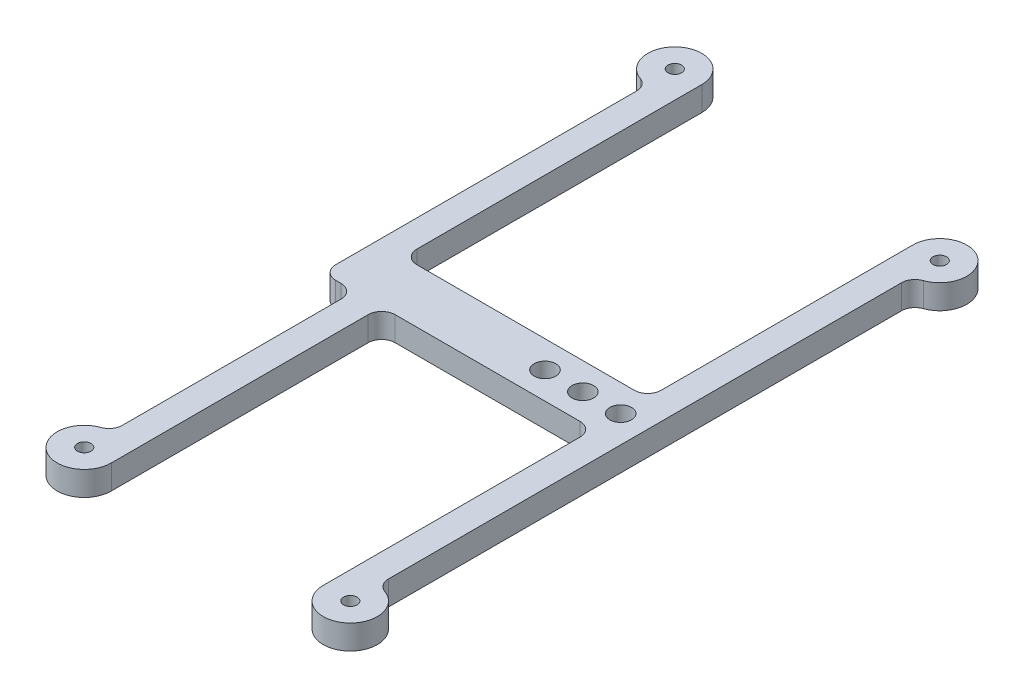
ISO-10303-21;
HEADER;
FILE_DESCRIPTION(('STEP AP214'),'2;1');
FILE_NAME('part.step','',(''),(''),'','','');
FILE_SCHEMA(('AUTOMOTIVE_DESIGN { 1 0 10303 214 1 1 1 1 }'));
ENDSEC;
DATA;
#1=APPLICATION_CONTEXT('core data for automotive mechanical design processes');
#2=APPLICATION_PROTOCOL_DEFINITION('international standard','automotive_design',2000,#1);
#3=PRODUCT_CONTEXT('',#1,'mechanical');
#4=PRODUCT('Part','Part','',(#3));
#5=PRODUCT_RELATED_PRODUCT_CATEGORY('part','',(#4));
#6=PRODUCT_DEFINITION_FORMATION('','',#4);
#7=PRODUCT_DEFINITION_CONTEXT('part definition',#1,'design');
#8=PRODUCT_DEFINITION('design','',#6,#7);
#9=PRODUCT_DEFINITION_SHAPE('','',#8);
#10=(LENGTH_UNIT() NAMED_UNIT(*) SI_UNIT(.MILLI.,.METRE.));
#11=(NAMED_UNIT(*) PLANE_ANGLE_UNIT() SI_UNIT($,.RADIAN.));
#12=(NAMED_UNIT(*) SI_UNIT($,.STERADIAN.) SOLID_ANGLE_UNIT());
#13=UNCERTAINTY_MEASURE_WITH_UNIT(LENGTH_MEASURE(1.E-05),#10,'distance_accuracy_value','');
#14=(GEOMETRIC_REPRESENTATION_CONTEXT(3) GLOBAL_UNCERTAINTY_ASSIGNED_CONTEXT((#13)) GLOBAL_UNIT_ASSIGNED_CONTEXT((#10,
#11,#12)) REPRESENTATION_CONTEXT('',''));
#15=CARTESIAN_POINT('',(0.,0.,0.));
#16=DIRECTION('',(0.,0.,1.));
#17=DIRECTION('',(1.,0.,0.));
#18=AXIS2_PLACEMENT_3D('',#15,#16,#17);
#19=CARTESIAN_POINT('',(-1.,4.5,0.));
#20=DIRECTION('',(1.,0.,0.));
#21=DIRECTION('',(0.,0.,-1.));
#22=AXIS2_PLACEMENT_3D('',#19,#20,#21);
#23=PLANE('',#22);
#24=DIRECTION('',(0.,0.,1.));
#25=VECTOR('',#24,1.);
#26=CARTESIAN_POINT('',(-1.,4.5,0.));
#27=LINE('',#26,#25);
#28=CARTESIAN_POINT('',(-1.00000000000001,4.5,-115.2));
#29=VERTEX_POINT('',#28);
#30=CARTESIAN_POINT('',(-1.00000000000001,4.5,-62.5));
#31=VERTEX_POINT('',#30);
#32=EDGE_CURVE('E201',#29,#31,#27,.T.);
#33=ORIENTED_EDGE('',*,*,#32,.T.);
#34=DIRECTION('',(0.,-1.,0.));
#35=VECTOR('',#34,1.);
#36=CARTESIAN_POINT('',(-1.00000000000001,4.5,-62.5));
#37=LINE('',#36,#35);
#38=CARTESIAN_POINT('',(-1.00000000000001,0.,-62.5));
#39=VERTEX_POINT('',#38);
#40=EDGE_CURVE('E356',#31,#39,#37,.T.);
#41=ORIENTED_EDGE('',*,*,#40,.T.);
#42=DIRECTION('',(0.,0.,1.));
#43=VECTOR('',#42,1.);
#44=CARTESIAN_POINT('',(-1.,0.,0.));
#45=LINE('',#44,#43);
#46=CARTESIAN_POINT('',(-1.00000000000001,0.,-115.2));
#47=VERTEX_POINT('',#46);
#48=EDGE_CURVE('E204',#47,#39,#45,.T.);
#49=ORIENTED_EDGE('',*,*,#48,.F.);
#50=DIRECTION('',(0.,-1.,0.));
#51=VECTOR('',#50,1.);
#52=CARTESIAN_POINT('',(-1.00000000000001,4.5,-115.2));
#53=LINE('',#52,#51);
#54=EDGE_CURVE('E197',#29,#47,#53,.T.);
#55=ORIENTED_EDGE('',*,*,#54,.F.);
#56=EDGE_LOOP('',(#33,#41,#49,#55));
#57=FACE_BOUND('',#56,.T.);
#58=ADVANCED_FACE('F35',(#57),#23,.T.);
#59=CARTESIAN_POINT('',(-6.00000000000002,4.5,-115.2));
#60=DIRECTION('',(0.,-1.,0.));
#61=DIRECTION('',(0.,0.,-1.));
#62=AXIS2_PLACEMENT_3D('',#59,#60,#61);
#63=CYLINDRICAL_SURFACE('',#62,5.);
#64=CARTESIAN_POINT('',(-6.00000000000002,0.,-115.2));
#65=DIRECTION('',(0.,1.,0.));
#66=DIRECTION('',(0.,0.,1.));
#67=AXIS2_PLACEMENT_3D('',#64,#65,#66);
#68=CIRCLE('',#67,5.);
#69=CARTESIAN_POINT('',(-7.66666666666668,0.,-110.48595479209));
#70=VERTEX_POINT('',#69);
#71=EDGE_CURVE('E283',#47,#70,#68,.T.);
#72=ORIENTED_EDGE('',*,*,#71,.T.);
#73=DIRECTION('',(0.,-1.,0.));
#74=VECTOR('',#73,1.);
#75=CARTESIAN_POINT('',(-7.66666666666668,4.5,-110.48595479209));
#76=LINE('',#75,#74);
#77=CARTESIAN_POINT('',(-7.66666666666668,4.5,-110.48595479209));
#78=VERTEX_POINT('',#77);
#79=EDGE_CURVE('E215',#70,#78,#76,.F.);
#80=ORIENTED_EDGE('',*,*,#79,.T.);
#81=CARTESIAN_POINT('',(-6.00000000000002,4.5,-115.2));
#82=DIRECTION('',(0.,1.,0.));
#83=DIRECTION('',(0.,0.,1.));
#84=AXIS2_PLACEMENT_3D('',#81,#82,#83);
#85=CIRCLE('',#84,5.);
#86=EDGE_CURVE('E212',#29,#78,#85,.T.);
#87=ORIENTED_EDGE('',*,*,#86,.F.);
#88=ORIENTED_EDGE('',*,*,#54,.T.);
#89=EDGE_LOOP('',(#72,#80,#87,#88));
#90=FACE_BOUND('',#89,.T.);
#91=ADVANCED_FACE('F213',(#90),#63,.T.);
#92=CARTESIAN_POINT('',(-6.,4.5,0.));
#93=DIRECTION('',(1.,0.,0.));
#94=DIRECTION('',(0.,0.,-1.));
#95=AXIS2_PLACEMENT_3D('',#92,#93,#94);
#96=PLANE('',#95);
#97=DIRECTION('',(0.,0.,1.));
#98=VECTOR('',#97,1.);
#99=CARTESIAN_POINT('',(-6.,4.5,0.));
#100=LINE('',#99,#98);
#101=CARTESIAN_POINT('',(-6.00000000000001,4.5,-108.128932188135));
#102=VERTEX_POINT('',#101);
#103=CARTESIAN_POINT('',(-6.00000000000001,4.5,-52.5));
#104=VERTEX_POINT('',#103);
#105=EDGE_CURVE('E217',#102,#104,#100,.T.);
#106=ORIENTED_EDGE('',*,*,#105,.F.);
#107=DIRECTION('',(0.,1.,0.));
#108=VECTOR('',#107,1.);
#109=CARTESIAN_POINT('',(-6.00000000000001,0.,-108.128932188135));
#110=LINE('',#109,#108);
#111=CARTESIAN_POINT('',(-6.00000000000001,0.,-108.128932188135));
#112=VERTEX_POINT('',#111);
#113=EDGE_CURVE('E380',#102,#112,#110,.F.);
#114=ORIENTED_EDGE('',*,*,#113,.T.);
#115=DIRECTION('',(0.,0.,1.));
#116=VECTOR('',#115,1.);
#117=CARTESIAN_POINT('',(-6.,0.,0.));
#118=LINE('',#117,#116);
#119=CARTESIAN_POINT('',(-6.00000000000001,0.,-52.5));
#120=VERTEX_POINT('',#119);
#121=EDGE_CURVE('E285',#112,#120,#118,.T.);
#122=ORIENTED_EDGE('',*,*,#121,.T.);
#123=DIRECTION('',(0.,-1.,0.));
#124=VECTOR('',#123,1.);
#125=CARTESIAN_POINT('',(-6.00000000000001,4.5,-52.5));
#126=LINE('',#125,#124);
#127=EDGE_CURVE('E378',#120,#104,#126,.F.);
#128=ORIENTED_EDGE('',*,*,#127,.T.);
#129=EDGE_LOOP('',(#106,#114,#122,#128));
#130=FACE_BOUND('',#129,.T.);
#131=ADVANCED_FACE('F516',(#130),#96,.F.);
#132=CARTESIAN_POINT('',(0.,4.5,-50.));
#133=DIRECTION('',(0.,0.,1.));
#134=DIRECTION('',(1.,0.,0.));
#135=AXIS2_PLACEMENT_3D('',#132,#133,#134);
#136=PLANE('',#135);
#137=DIRECTION('',(-1.,0.,0.));
#138=VECTOR('',#137,1.);
#139=CARTESIAN_POINT('',(0.,0.,-50.));
#140=LINE('',#139,#138);
#141=CARTESIAN_POINT('',(-2.5,0.,-50.));
#142=VERTEX_POINT('',#141);
#143=CARTESIAN_POINT('',(-3.50000000000001,0.,-50.));
#144=VERTEX_POINT('',#143);
#145=EDGE_CURVE('E288',#142,#144,#140,.T.);
#146=ORIENTED_EDGE('',*,*,#145,.F.);
#147=DIRECTION('',(0.,-1.,0.));
#148=VECTOR('',#147,1.);
#149=CARTESIAN_POINT('',(-2.5,4.5,-50.));
#150=LINE('',#149,#148);
#151=CARTESIAN_POINT('',(-2.5,4.5,-50.));
#152=VERTEX_POINT('',#151);
#153=EDGE_CURVE('E57',#142,#152,#150,.F.);
#154=ORIENTED_EDGE('',*,*,#153,.T.);
#155=DIRECTION('',(-1.,0.,0.));
#156=VECTOR('',#155,1.);
#157=CARTESIAN_POINT('',(0.,4.5,-50.));
#158=LINE('',#157,#156);
#159=CARTESIAN_POINT('',(-3.50000000000001,4.5,-50.));
#160=VERTEX_POINT('',#159);
#161=EDGE_CURVE('E231',#152,#160,#158,.T.);
#162=ORIENTED_EDGE('',*,*,#161,.T.);
#163=DIRECTION('',(0.,-1.,0.));
#164=VECTOR('',#163,1.);
#165=CARTESIAN_POINT('',(-3.50000000000001,0.,-50.));
#166=LINE('',#165,#164);
#167=EDGE_CURVE('E384',#160,#144,#166,.T.);
#168=ORIENTED_EDGE('',*,*,#167,.T.);
#169=EDGE_LOOP('',(#146,#154,#162,#168));
#170=FACE_BOUND('',#169,.T.);
#171=ADVANCED_FACE('F427',(#170),#136,.T.);
#172=CARTESIAN_POINT('',(0.,4.5,0.));
#173=DIRECTION('',(-1.,0.,0.));
#174=DIRECTION('',(0.,0.,1.));
#175=AXIS2_PLACEMENT_3D('',#172,#173,#174);
#176=PLANE('',#175);
#177=DIRECTION('',(0.,0.,-1.));
#178=VECTOR('',#177,1.);
#179=CARTESIAN_POINT('',(0.,0.,0.));
#180=LINE('',#179,#178);
#181=CARTESIAN_POINT('',(0.,0.,-7.07106781186548));
#182=VERTEX_POINT('',#181);
#183=CARTESIAN_POINT('',(0.,0.,-47.5));
#184=VERTEX_POINT('',#183);
#185=EDGE_CURVE('E291',#182,#184,#180,.T.);
#186=ORIENTED_EDGE('',*,*,#185,.F.);
#187=DIRECTION('',(0.,-1.,0.));
#188=VECTOR('',#187,1.);
#189=CARTESIAN_POINT('',(0.,4.5,-7.07106781186548));
#190=LINE('',#189,#188);
#191=CARTESIAN_POINT('',(0.,4.5,-7.07106781186548));
#192=VERTEX_POINT('',#191);
#193=EDGE_CURVE('E371',#182,#192,#190,.F.);
#194=ORIENTED_EDGE('',*,*,#193,.T.);
#195=DIRECTION('',(0.,0.,-1.));
#196=VECTOR('',#195,1.);
#197=CARTESIAN_POINT('',(0.,4.5,0.));
#198=LINE('',#197,#196);
#199=CARTESIAN_POINT('',(0.,4.5,-47.5));
#200=VERTEX_POINT('',#199);
#201=EDGE_CURVE('E233',#192,#200,#198,.T.);
#202=ORIENTED_EDGE('',*,*,#201,.T.);
#203=DIRECTION('',(0.,-1.,0.));
#204=VECTOR('',#203,1.);
#205=CARTESIAN_POINT('',(0.,0.,-47.5));
#206=LINE('',#205,#204);
#207=EDGE_CURVE('E368',#200,#184,#206,.T.);
#208=ORIENTED_EDGE('',*,*,#207,.T.);
#209=EDGE_LOOP('',(#186,#194,#202,#208));
#210=FACE_BOUND('',#209,.T.);
#211=ADVANCED_FACE('F434',(#210),#176,.T.);
#212=CARTESIAN_POINT('',(0.,4.5,0.));
#213=DIRECTION('',(0.,-1.,0.));
#214=DIRECTION('',(0.,0.,-1.));
#215=AXIS2_PLACEMENT_3D('',#212,#213,#214);
#216=CYLINDRICAL_SURFACE('',#215,5.);
#217=CARTESIAN_POINT('',(0.,4.5,0.));
#218=DIRECTION('',(0.,1.,0.));
#219=DIRECTION('',(0.,0.,1.));
#220=AXIS2_PLACEMENT_3D('',#217,#218,#219);
#221=CIRCLE('',#220,5.);
#222=CARTESIAN_POINT('',(-1.66666666666667,4.5,-4.71404520791032));
#223=VERTEX_POINT('',#222);
#224=CARTESIAN_POINT('',(5.,4.5,0.));
#225=VERTEX_POINT('',#224);
#226=EDGE_CURVE('E236',#223,#225,#221,.T.);
#227=ORIENTED_EDGE('',*,*,#226,.F.);
#228=DIRECTION('',(0.,-1.,0.));
#229=VECTOR('',#228,1.);
#230=CARTESIAN_POINT('',(-1.66666666666667,4.5,-4.71404520791032));
#231=LINE('',#230,#229);
#232=CARTESIAN_POINT('',(-1.66666666666667,0.,-4.71404520791032));
#233=VERTEX_POINT('',#232);
#234=EDGE_CURVE('E365',#223,#233,#231,.T.);
#235=ORIENTED_EDGE('',*,*,#234,.T.);
#236=CARTESIAN_POINT('',(0.,0.,0.));
#237=DIRECTION('',(0.,1.,0.));
#238=DIRECTION('',(0.,0.,1.));
#239=AXIS2_PLACEMENT_3D('',#236,#237,#238);
#240=CIRCLE('',#239,5.);
#241=CARTESIAN_POINT('',(5.,0.,0.));
#242=VERTEX_POINT('',#241);
#243=EDGE_CURVE('E294',#233,#242,#240,.T.);
#244=ORIENTED_EDGE('',*,*,#243,.T.);
#245=DIRECTION('',(0.,-1.,0.));
#246=VECTOR('',#245,1.);
#247=CARTESIAN_POINT('',(5.,4.5,0.));
#248=LINE('',#247,#246);
#249=EDGE_CURVE('E209',#225,#242,#248,.T.);
#250=ORIENTED_EDGE('',*,*,#249,.F.);
#251=EDGE_LOOP('',(#227,#235,#244,#250));
#252=FACE_BOUND('',#251,.T.);
#253=ADVANCED_FACE('F442',(#252),#216,.T.);
#254=CARTESIAN_POINT('',(5.,4.5,0.));
#255=DIRECTION('',(-1.,0.,0.));
#256=DIRECTION('',(0.,0.,1.));
#257=AXIS2_PLACEMENT_3D('',#254,#255,#256);
#258=PLANE('',#257);
#259=DIRECTION('',(0.,0.,-1.));
#260=VECTOR('',#259,1.);
#261=CARTESIAN_POINT('',(5.,0.,0.));
#262=LINE('',#261,#260);
#263=CARTESIAN_POINT('',(5.,0.,-47.5));
#264=VERTEX_POINT('',#263);
#265=EDGE_CURVE('E296',#242,#264,#262,.T.);
#266=ORIENTED_EDGE('',*,*,#265,.T.);
#267=DIRECTION('',(0.,-1.,0.));
#268=VECTOR('',#267,1.);
#269=CARTESIAN_POINT('',(5.,4.5,-47.5));
#270=LINE('',#269,#268);
#271=CARTESIAN_POINT('',(5.,4.5,-47.5));
#272=VERTEX_POINT('',#271);
#273=EDGE_CURVE('E346',#264,#272,#270,.F.);
#274=ORIENTED_EDGE('',*,*,#273,.T.);
#275=DIRECTION('',(0.,0.,-1.));
#276=VECTOR('',#275,1.);
#277=CARTESIAN_POINT('',(5.,4.5,0.));
#278=LINE('',#277,#276);
#279=EDGE_CURVE('E238',#225,#272,#278,.T.);
#280=ORIENTED_EDGE('',*,*,#279,.F.);
#281=ORIENTED_EDGE('',*,*,#249,.T.);
#282=EDGE_LOOP('',(#266,#274,#280,#281));
#283=FACE_BOUND('',#282,.T.);
#284=ADVANCED_FACE('F447',(#283),#258,.F.);
#285=CARTESIAN_POINT('',(0.,4.5,-50.));
#286=DIRECTION('',(0.,0.,1.));
#287=DIRECTION('',(1.,0.,0.));
#288=AXIS2_PLACEMENT_3D('',#285,#286,#287);
#289=PLANE('',#288);
#290=DIRECTION('',(-1.,0.,0.));
#291=VECTOR('',#290,1.);
#292=CARTESIAN_POINT('',(0.,4.5,-50.));
#293=LINE('',#292,#291);
#294=CARTESIAN_POINT('',(41.7,4.5,-50.));
#295=VERTEX_POINT('',#294);
#296=CARTESIAN_POINT('',(7.5,4.5,-50.));
#297=VERTEX_POINT('',#296);
#298=EDGE_CURVE('E241',#295,#297,#293,.T.);
#299=ORIENTED_EDGE('',*,*,#298,.T.);
#300=DIRECTION('',(0.,-1.,0.));
#301=VECTOR('',#300,1.);
#302=CARTESIAN_POINT('',(7.5,4.5,-50.));
#303=LINE('',#302,#301);
#304=CARTESIAN_POINT('',(7.5,0.,-50.));
#305=VERTEX_POINT('',#304);
#306=EDGE_CURVE('E343',#297,#305,#303,.T.);
#307=ORIENTED_EDGE('',*,*,#306,.T.);
#308=DIRECTION('',(-1.,0.,0.));
#309=VECTOR('',#308,1.);
#310=CARTESIAN_POINT('',(0.,0.,-50.));
#311=LINE('',#310,#309);
#312=CARTESIAN_POINT('',(41.7,0.,-50.));
#313=VERTEX_POINT('',#312);
#314=EDGE_CURVE('E299',#313,#305,#311,.T.);
#315=ORIENTED_EDGE('',*,*,#314,.F.);
#316=DIRECTION('',(0.,-1.,0.));
#317=VECTOR('',#316,1.);
#318=CARTESIAN_POINT('',(41.7,4.5,-50.));
#319=LINE('',#318,#317);
#320=EDGE_CURVE('E208',#313,#295,#319,.F.);
#321=ORIENTED_EDGE('',*,*,#320,.T.);
#322=EDGE_LOOP('',(#299,#307,#315,#321));
#323=FACE_BOUND('',#322,.T.);
#324=ADVANCED_FACE('F456',(#323),#289,.T.);
#325=CARTESIAN_POINT('',(44.2,4.5,0.));
#326=DIRECTION('',(-1.,0.,0.));
#327=DIRECTION('',(0.,0.,1.));
#328=AXIS2_PLACEMENT_3D('',#325,#326,#327);
#329=PLANE('',#328);
#330=DIRECTION('',(0.,0.,-1.));
#331=VECTOR('',#330,1.);
#332=CARTESIAN_POINT('',(44.2,4.5,0.));
#333=LINE('',#332,#331);
#334=CARTESIAN_POINT('',(44.2,4.5,0.));
#335=VERTEX_POINT('',#334);
#336=CARTESIAN_POINT('',(44.2,4.5,-47.5));
#337=VERTEX_POINT('',#336);
#338=EDGE_CURVE('E244',#335,#337,#333,.T.);
#339=ORIENTED_EDGE('',*,*,#338,.T.);
#340=DIRECTION('',(0.,-1.,0.));
#341=VECTOR('',#340,1.);
#342=CARTESIAN_POINT('',(44.2,0.,-47.5));
#343=LINE('',#342,#341);
#344=CARTESIAN_POINT('',(44.2,0.,-47.5));
#345=VERTEX_POINT('',#344);
#346=EDGE_CURVE('E375',#337,#345,#343,.T.);
#347=ORIENTED_EDGE('',*,*,#346,.T.);
#348=DIRECTION('',(0.,0.,-1.));
#349=VECTOR('',#348,1.);
#350=CARTESIAN_POINT('',(44.2,0.,0.));
#351=LINE('',#350,#349);
#352=CARTESIAN_POINT('',(44.2,0.,0.));
#353=VERTEX_POINT('',#352);
#354=EDGE_CURVE('E302',#353,#345,#351,.T.);
#355=ORIENTED_EDGE('',*,*,#354,.F.);
#356=DIRECTION('',(0.,-1.,0.));
#357=VECTOR('',#356,1.);
#358=CARTESIAN_POINT('',(44.2,4.5,0.));
#359=LINE('',#358,#357);
#360=EDGE_CURVE('E338',#335,#353,#359,.T.);
#361=ORIENTED_EDGE('',*,*,#360,.F.);
#362=EDGE_LOOP('',(#339,#347,#355,#361));
#363=FACE_BOUND('',#362,.T.);
#364=ADVANCED_FACE('F465',(#363),#329,.T.);
#365=CARTESIAN_POINT('',(49.2,4.5,0.));
#366=DIRECTION('',(0.,-1.,0.));
#367=DIRECTION('',(0.,0.,-1.));
#368=AXIS2_PLACEMENT_3D('',#365,#366,#367);
#369=CYLINDRICAL_SURFACE('',#368,5.);
#370=CARTESIAN_POINT('',(49.2,0.,0.));
#371=DIRECTION('',(0.,1.,0.));
#372=DIRECTION('',(0.,0.,1.));
#373=AXIS2_PLACEMENT_3D('',#370,#371,#372);
#374=CIRCLE('',#373,5.);
#375=CARTESIAN_POINT('',(50.8666666666667,0.,-4.71404520791032));
#376=VERTEX_POINT('',#375);
#377=EDGE_CURVE('E305',#353,#376,#374,.T.);
#378=ORIENTED_EDGE('',*,*,#377,.T.);
#379=DIRECTION('',(0.,-1.,0.));
#380=VECTOR('',#379,1.);
#381=CARTESIAN_POINT('',(50.8666666666667,4.5,-4.71404520791032));
#382=LINE('',#381,#380);
#383=CARTESIAN_POINT('',(50.8666666666667,4.5,-4.71404520791032));
#384=VERTEX_POINT('',#383);
#385=EDGE_CURVE('E363',#376,#384,#382,.F.);
#386=ORIENTED_EDGE('',*,*,#385,.T.);
#387=CARTESIAN_POINT('',(49.2,4.5,0.));
#388=DIRECTION('',(0.,1.,0.));
#389=DIRECTION('',(0.,0.,1.));
#390=AXIS2_PLACEMENT_3D('',#387,#388,#389);
#391=CIRCLE('',#390,5.);
#392=EDGE_CURVE('E247',#335,#384,#391,.T.);
#393=ORIENTED_EDGE('',*,*,#392,.F.);
#394=ORIENTED_EDGE('',*,*,#360,.T.);
#395=EDGE_LOOP('',(#378,#386,#393,#394));
#396=FACE_BOUND('',#395,.T.);
#397=ADVANCED_FACE('F567',(#396),#369,.T.);
#398=CARTESIAN_POINT('',(49.2,4.5,0.));
#399=DIRECTION('',(-1.,0.,0.));
#400=DIRECTION('',(0.,0.,1.));
#401=AXIS2_PLACEMENT_3D('',#398,#399,#400);
#402=PLANE('',#401);
#403=DIRECTION('',(0.,0.,-1.));
#404=VECTOR('',#403,1.);
#405=CARTESIAN_POINT('',(49.2,0.,0.));
#406=LINE('',#405,#404);
#407=CARTESIAN_POINT('',(49.2,0.,-7.07106781186547));
#408=VERTEX_POINT('',#407);
#409=CARTESIAN_POINT('',(49.2,0.,-101.928932188135));
#410=VERTEX_POINT('',#409);
#411=EDGE_CURVE('E308',#408,#410,#406,.T.);
#412=ORIENTED_EDGE('',*,*,#411,.T.);
#413=DIRECTION('',(0.,1.,0.));
#414=VECTOR('',#413,1.);
#415=CARTESIAN_POINT('',(49.2,4.5,-101.928932188135));
#416=LINE('',#415,#414);
#417=CARTESIAN_POINT('',(49.2,4.5,-101.928932188135));
#418=VERTEX_POINT('',#417);
#419=EDGE_CURVE('E354',#410,#418,#416,.T.);
#420=ORIENTED_EDGE('',*,*,#419,.T.);
#421=DIRECTION('',(0.,0.,-1.));
#422=VECTOR('',#421,1.);
#423=CARTESIAN_POINT('',(49.2,4.5,0.));
#424=LINE('',#423,#422);
#425=CARTESIAN_POINT('',(49.2,4.5,-7.07106781186547));
#426=VERTEX_POINT('',#425);
#427=EDGE_CURVE('E250',#426,#418,#424,.T.);
#428=ORIENTED_EDGE('',*,*,#427,.F.);
#429=DIRECTION('',(0.,1.,0.));
#430=VECTOR('',#429,1.);
#431=CARTESIAN_POINT('',(49.2,0.,-7.07106781186547));
#432=LINE('',#431,#430);
#433=EDGE_CURVE('E351',#426,#408,#432,.F.);
#434=ORIENTED_EDGE('',*,*,#433,.T.);
#435=EDGE_LOOP('',(#412,#420,#428,#434));
#436=FACE_BOUND('',#435,.T.);
#437=ADVANCED_FACE('F477',(#436),#402,.F.);
#438=CARTESIAN_POINT('',(49.2,4.5,-109.));
#439=DIRECTION('',(0.,-1.,0.));
#440=DIRECTION('',(0.,0.,-1.));
#441=AXIS2_PLACEMENT_3D('',#438,#439,#440);
#442=CYLINDRICAL_SURFACE('',#441,5.);
#443=CARTESIAN_POINT('',(49.2,4.5,-109.));
#444=DIRECTION('',(0.,1.,0.));
#445=DIRECTION('',(0.,0.,1.));
#446=AXIS2_PLACEMENT_3D('',#443,#444,#445);
#447=CIRCLE('',#446,5.);
#448=CARTESIAN_POINT('',(50.8666666666667,4.5,-104.28595479209));
#449=VERTEX_POINT('',#448);
#450=CARTESIAN_POINT('',(44.2,4.5,-109.));
#451=VERTEX_POINT('',#450);
#452=EDGE_CURVE('E253',#449,#451,#447,.T.);
#453=ORIENTED_EDGE('',*,*,#452,.F.);
#454=DIRECTION('',(0.,-1.,0.));
#455=VECTOR('',#454,1.);
#456=CARTESIAN_POINT('',(50.8666666666667,4.5,-104.28595479209));
#457=LINE('',#456,#455);
#458=CARTESIAN_POINT('',(50.8666666666667,0.,-104.28595479209));
#459=VERTEX_POINT('',#458);
#460=EDGE_CURVE('E348',#449,#459,#457,.T.);
#461=ORIENTED_EDGE('',*,*,#460,.T.);
#462=CARTESIAN_POINT('',(49.2,0.,-109.));
#463=DIRECTION('',(0.,1.,0.));
#464=DIRECTION('',(0.,0.,1.));
#465=AXIS2_PLACEMENT_3D('',#462,#463,#464);
#466=CIRCLE('',#465,5.);
#467=CARTESIAN_POINT('',(44.2,0.,-109.));
#468=VERTEX_POINT('',#467);
#469=EDGE_CURVE('E311',#459,#468,#466,.T.);
#470=ORIENTED_EDGE('',*,*,#469,.T.);
#471=DIRECTION('',(0.,-1.,0.));
#472=VECTOR('',#471,1.);
#473=CARTESIAN_POINT('',(44.2,4.5,-109.));
#474=LINE('',#473,#472);
#475=EDGE_CURVE('E281',#451,#468,#474,.T.);
#476=ORIENTED_EDGE('',*,*,#475,.F.);
#477=EDGE_LOOP('',(#453,#461,#470,#476));
#478=FACE_BOUND('',#477,.T.);
#479=ADVANCED_FACE('F487',(#478),#442,.T.);
#480=CARTESIAN_POINT('',(44.2,4.5,0.));
#481=DIRECTION('',(1.,0.,0.));
#482=DIRECTION('',(0.,0.,-1.));
#483=AXIS2_PLACEMENT_3D('',#480,#481,#482);
#484=PLANE('',#483);
#485=DIRECTION('',(0.,0.,1.));
#486=VECTOR('',#485,1.);
#487=CARTESIAN_POINT('',(44.2,0.,0.));
#488=LINE('',#487,#486);
#489=CARTESIAN_POINT('',(44.2,0.,-62.5));
#490=VERTEX_POINT('',#489);
#491=EDGE_CURVE('E313',#468,#490,#488,.T.);
#492=ORIENTED_EDGE('',*,*,#491,.T.);
#493=DIRECTION('',(0.,-1.,0.));
#494=VECTOR('',#493,1.);
#495=CARTESIAN_POINT('',(44.2,4.5,-62.5));
#496=LINE('',#495,#494);
#497=CARTESIAN_POINT('',(44.2,4.5,-62.5));
#498=VERTEX_POINT('',#497);
#499=EDGE_CURVE('E373',#490,#498,#496,.F.);
#500=ORIENTED_EDGE('',*,*,#499,.T.);
#501=DIRECTION('',(0.,0.,1.));
#502=VECTOR('',#501,1.);
#503=CARTESIAN_POINT('',(44.2,4.5,0.));
#504=LINE('',#503,#502);
#505=EDGE_CURVE('E255',#451,#498,#504,.T.);
#506=ORIENTED_EDGE('',*,*,#505,.F.);
#507=ORIENTED_EDGE('',*,*,#475,.T.);
#508=EDGE_LOOP('',(#492,#500,#506,#507));
#509=FACE_BOUND('',#508,.T.);
#510=ADVANCED_FACE('F538',(#509),#484,.F.);
#511=CARTESIAN_POINT('',(37.2,4.5,-55.));
#512=DIRECTION('',(0.,-1.,0.));
#513=DIRECTION('',(0.,0.,-1.));
#514=AXIS2_PLACEMENT_3D('',#511,#512,#513);
#515=CYLINDRICAL_SURFACE('',#514,2.);
#516=CARTESIAN_POINT('',(37.2,4.5,-55.));
#517=DIRECTION('',(0.,1.,0.));
#518=DIRECTION('',(0.,0.,1.));
#519=AXIS2_PLACEMENT_3D('',#516,#517,#518);
#520=CIRCLE('',#519,2.);
#521=CARTESIAN_POINT('',(37.2,4.5,-53.));
#522=VERTEX_POINT('',#521);
#523=EDGE_CURVE('E275',#522,#522,#520,.T.);
#524=ORIENTED_EDGE('',*,*,#523,.T.);
#525=EDGE_LOOP('',(#524));
#526=FACE_BOUND('',#525,.T.);
#527=CARTESIAN_POINT('',(37.2,0.,-55.));
#528=DIRECTION('',(0.,1.,0.));
#529=DIRECTION('',(0.,0.,1.));
#530=AXIS2_PLACEMENT_3D('',#527,#528,#529);
#531=CIRCLE('',#530,2.);
#532=CARTESIAN_POINT('',(37.2,0.,-53.));
#533=VERTEX_POINT('',#532);
#534=EDGE_CURVE('E227',#533,#533,#531,.T.);
#535=ORIENTED_EDGE('',*,*,#534,.F.);
#536=EDGE_LOOP('',(#535));
#537=FACE_BOUND('',#536,.T.);
#538=ADVANCED_FACE('F534',(#526,#537),#515,.F.);
#539=CARTESIAN_POINT('',(30.2,4.5,-55.));
#540=DIRECTION('',(0.,-1.,0.));
#541=DIRECTION('',(0.,0.,-1.));
#542=AXIS2_PLACEMENT_3D('',#539,#540,#541);
#543=CYLINDRICAL_SURFACE('',#542,2.);
#544=CARTESIAN_POINT('',(30.2,4.5,-55.));
#545=DIRECTION('',(0.,1.,0.));
#546=DIRECTION('',(0.,0.,1.));
#547=AXIS2_PLACEMENT_3D('',#544,#545,#546);
#548=CIRCLE('',#547,2.);
#549=CARTESIAN_POINT('',(30.2,4.5,-53.));
#550=VERTEX_POINT('',#549);
#551=EDGE_CURVE('E272',#550,#550,#548,.T.);
#552=ORIENTED_EDGE('',*,*,#551,.T.);
#553=EDGE_LOOP('',(#552));
#554=FACE_BOUND('',#553,.T.);
#555=CARTESIAN_POINT('',(30.2,0.,-55.));
#556=DIRECTION('',(0.,1.,0.));
#557=DIRECTION('',(0.,0.,1.));
#558=AXIS2_PLACEMENT_3D('',#555,#556,#557);
#559=CIRCLE('',#558,2.);
#560=CARTESIAN_POINT('',(30.2,0.,-53.));
#561=VERTEX_POINT('',#560);
#562=EDGE_CURVE('E331',#561,#561,#559,.T.);
#563=ORIENTED_EDGE('',*,*,#562,.F.);
#564=EDGE_LOOP('',(#563));
#565=FACE_BOUND('',#564,.T.);
#566=ADVANCED_FACE('F537',(#554,#565),#543,.F.);
#567=CARTESIAN_POINT('',(-6.00000000000002,4.5,-115.2));
#568=DIRECTION('',(0.,-1.,0.));
#569=DIRECTION('',(0.,0.,-1.));
#570=AXIS2_PLACEMENT_3D('',#567,#568,#569);
#571=CYLINDRICAL_SURFACE('',#570,1.25);
#572=CARTESIAN_POINT('',(-6.00000000000002,4.5,-115.2));
#573=DIRECTION('',(0.,1.,0.));
#574=DIRECTION('',(0.,0.,1.));
#575=AXIS2_PLACEMENT_3D('',#572,#573,#574);
#576=CIRCLE('',#575,1.25);
#577=CARTESIAN_POINT('',(-6.00000000000002,4.5,-113.95));
#578=VERTEX_POINT('',#577);
#579=EDGE_CURVE('E269',#578,#578,#576,.T.);
#580=ORIENTED_EDGE('',*,*,#579,.T.);
#581=EDGE_LOOP('',(#580));
#582=FACE_BOUND('',#581,.T.);
#583=CARTESIAN_POINT('',(-6.00000000000002,0.,-115.2));
#584=DIRECTION('',(0.,1.,0.));
#585=DIRECTION('',(0.,0.,1.));
#586=AXIS2_PLACEMENT_3D('',#583,#584,#585);
#587=CIRCLE('',#586,1.25);
#588=CARTESIAN_POINT('',(-6.00000000000002,0.,-113.95));
#589=VERTEX_POINT('',#588);
#590=EDGE_CURVE('E328',#589,#589,#587,.T.);
#591=ORIENTED_EDGE('',*,*,#590,.F.);
#592=EDGE_LOOP('',(#591));
#593=FACE_BOUND('',#592,.T.);
#594=ADVANCED_FACE('F542',(#582,#593),#571,.F.);
#595=CARTESIAN_POINT('',(49.2,4.5,-109.));
#596=DIRECTION('',(0.,-1.,0.));
#597=DIRECTION('',(0.,0.,-1.));
#598=AXIS2_PLACEMENT_3D('',#595,#596,#597);
#599=CYLINDRICAL_SURFACE('',#598,1.25);
#600=CARTESIAN_POINT('',(49.2,4.5,-109.));
#601=DIRECTION('',(0.,1.,0.));
#602=DIRECTION('',(0.,0.,1.));
#603=AXIS2_PLACEMENT_3D('',#600,#601,#602);
#604=CIRCLE('',#603,1.25);
#605=CARTESIAN_POINT('',(49.2,4.5,-107.75));
#606=VERTEX_POINT('',#605);
#607=EDGE_CURVE('E266',#606,#606,#604,.T.);
#608=ORIENTED_EDGE('',*,*,#607,.T.);
#609=EDGE_LOOP('',(#608));
#610=FACE_BOUND('',#609,.T.);
#611=CARTESIAN_POINT('',(49.2,0.,-109.));
#612=DIRECTION('',(0.,1.,0.));
#613=DIRECTION('',(0.,0.,1.));
#614=AXIS2_PLACEMENT_3D('',#611,#612,#613);
#615=CIRCLE('',#614,1.25);
#616=CARTESIAN_POINT('',(49.2,0.,-107.75));
#617=VERTEX_POINT('',#616);
#618=EDGE_CURVE('E325',#617,#617,#615,.T.);
#619=ORIENTED_EDGE('',*,*,#618,.F.);
#620=EDGE_LOOP('',(#619));
#621=FACE_BOUND('',#620,.T.);
#622=ADVANCED_FACE('F546',(#610,#621),#599,.F.);
#623=CARTESIAN_POINT('',(0.,4.5,0.));
#624=DIRECTION('',(0.,-1.,0.));
#625=DIRECTION('',(0.,0.,-1.));
#626=AXIS2_PLACEMENT_3D('',#623,#624,#625);
#627=CYLINDRICAL_SURFACE('',#626,1.25);
#628=CARTESIAN_POINT('',(0.,4.5,0.));
#629=DIRECTION('',(0.,1.,0.));
#630=DIRECTION('',(0.,0.,1.));
#631=AXIS2_PLACEMENT_3D('',#628,#629,#630);
#632=CIRCLE('',#631,1.25);
#633=CARTESIAN_POINT('',(0.,4.5,1.25));
#634=VERTEX_POINT('',#633);
#635=EDGE_CURVE('E263',#634,#634,#632,.T.);
#636=ORIENTED_EDGE('',*,*,#635,.T.);
#637=EDGE_LOOP('',(#636));
#638=FACE_BOUND('',#637,.T.);
#639=CARTESIAN_POINT('',(0.,0.,0.));
#640=DIRECTION('',(0.,1.,0.));
#641=DIRECTION('',(0.,0.,1.));
#642=AXIS2_PLACEMENT_3D('',#639,#640,#641);
#643=CIRCLE('',#642,1.25);
#644=CARTESIAN_POINT('',(0.,0.,1.25));
#645=VERTEX_POINT('',#644);
#646=EDGE_CURVE('E322',#645,#645,#643,.T.);
#647=ORIENTED_EDGE('',*,*,#646,.F.);
#648=EDGE_LOOP('',(#647));
#649=FACE_BOUND('',#648,.T.);
#650=ADVANCED_FACE('F550',(#638,#649),#627,.F.);
#651=CARTESIAN_POINT('',(49.2,4.5,0.));
#652=DIRECTION('',(0.,-1.,0.));
#653=DIRECTION('',(0.,0.,-1.));
#654=AXIS2_PLACEMENT_3D('',#651,#652,#653);
#655=CYLINDRICAL_SURFACE('',#654,1.25);
#656=CARTESIAN_POINT('',(49.2,4.5,0.));
#657=DIRECTION('',(0.,1.,0.));
#658=DIRECTION('',(0.,0.,1.));
#659=AXIS2_PLACEMENT_3D('',#656,#657,#658);
#660=CIRCLE('',#659,1.25);
#661=CARTESIAN_POINT('',(49.2,4.5,1.25));
#662=VERTEX_POINT('',#661);
#663=EDGE_CURVE('E260',#662,#662,#660,.T.);
#664=ORIENTED_EDGE('',*,*,#663,.T.);
#665=EDGE_LOOP('',(#664));
#666=FACE_BOUND('',#665,.T.);
#667=CARTESIAN_POINT('',(49.2,0.,0.));
#668=DIRECTION('',(0.,1.,0.));
#669=DIRECTION('',(0.,0.,1.));
#670=AXIS2_PLACEMENT_3D('',#667,#668,#669);
#671=CIRCLE('',#670,1.25);
#672=CARTESIAN_POINT('',(49.2,0.,1.25));
#673=VERTEX_POINT('',#672);
#674=EDGE_CURVE('E319',#673,#673,#671,.T.);
#675=ORIENTED_EDGE('',*,*,#674,.F.);
#676=EDGE_LOOP('',(#675));
#677=FACE_BOUND('',#676,.T.);
#678=ADVANCED_FACE('F554',(#666,#677),#655,.F.);
#679=CARTESIAN_POINT('',(0.,4.5,-60.));
#680=DIRECTION('',(0.,0.,1.));
#681=DIRECTION('',(1.,0.,0.));
#682=AXIS2_PLACEMENT_3D('',#679,#680,#681);
#683=PLANE('',#682);
#684=DIRECTION('',(-1.,0.,0.));
#685=VECTOR('',#684,1.);
#686=CARTESIAN_POINT('',(0.,0.,-60.));
#687=LINE('',#686,#685);
#688=CARTESIAN_POINT('',(41.7,0.,-60.));
#689=VERTEX_POINT('',#688);
#690=CARTESIAN_POINT('',(1.49999999999999,0.,-60.));
#691=VERTEX_POINT('',#690);
#692=EDGE_CURVE('E316',#689,#691,#687,.T.);
#693=ORIENTED_EDGE('',*,*,#692,.T.);
#694=DIRECTION('',(0.,-1.,0.));
#695=VECTOR('',#694,1.);
#696=CARTESIAN_POINT('',(1.49999999999999,4.5,-60.));
#697=LINE('',#696,#695);
#698=CARTESIAN_POINT('',(1.49999999999999,4.5,-60.));
#699=VERTEX_POINT('',#698);
#700=EDGE_CURVE('E361',#691,#699,#697,.F.);
#701=ORIENTED_EDGE('',*,*,#700,.T.);
#702=DIRECTION('',(-1.,0.,0.));
#703=VECTOR('',#702,1.);
#704=CARTESIAN_POINT('',(0.,4.5,-60.));
#705=LINE('',#704,#703);
#706=CARTESIAN_POINT('',(41.7,4.5,-60.));
#707=VERTEX_POINT('',#706);
#708=EDGE_CURVE('E258',#707,#699,#705,.T.);
#709=ORIENTED_EDGE('',*,*,#708,.F.);
#710=DIRECTION('',(0.,-1.,0.));
#711=VECTOR('',#710,1.);
#712=CARTESIAN_POINT('',(41.7,0.,-60.));
#713=LINE('',#712,#711);
#714=EDGE_CURVE('E358',#707,#689,#713,.T.);
#715=ORIENTED_EDGE('',*,*,#714,.T.);
#716=EDGE_LOOP('',(#693,#701,#709,#715));
#717=FACE_BOUND('',#716,.T.);
#718=ADVANCED_FACE('F499',(#717),#683,.F.);
#719=CARTESIAN_POINT('',(44.2,4.5,-55.));
#720=DIRECTION('',(0.,-1.,0.));
#721=DIRECTION('',(0.,0.,-1.));
#722=AXIS2_PLACEMENT_3D('',#719,#720,#721);
#723=CYLINDRICAL_SURFACE('',#722,2.);
#724=CARTESIAN_POINT('',(44.2,4.5,-55.));
#725=DIRECTION('',(0.,1.,0.));
#726=DIRECTION('',(0.,0.,1.));
#727=AXIS2_PLACEMENT_3D('',#724,#725,#726);
#728=CIRCLE('',#727,2.);
#729=CARTESIAN_POINT('',(44.2,4.5,-53.));
#730=VERTEX_POINT('',#729);
#731=EDGE_CURVE('E278',#730,#730,#728,.T.);
#732=ORIENTED_EDGE('',*,*,#731,.T.);
#733=EDGE_LOOP('',(#732));
#734=FACE_BOUND('',#733,.T.);
#735=CARTESIAN_POINT('',(44.2,0.,-55.));
#736=DIRECTION('',(0.,1.,0.));
#737=DIRECTION('',(0.,0.,1.));
#738=AXIS2_PLACEMENT_3D('',#735,#736,#737);
#739=CIRCLE('',#738,2.);
#740=CARTESIAN_POINT('',(44.2,0.,-53.));
#741=VERTEX_POINT('',#740);
#742=EDGE_CURVE('E224',#741,#741,#739,.T.);
#743=ORIENTED_EDGE('',*,*,#742,.F.);
#744=EDGE_LOOP('',(#743));
#745=FACE_BOUND('',#744,.T.);
#746=ADVANCED_FACE('F528',(#734,#745),#723,.F.);
#747=CARTESIAN_POINT('',(0.,4.5,0.));
#748=DIRECTION('',(0.,1.,0.));
#749=DIRECTION('',(0.,0.,1.));
#750=AXIS2_PLACEMENT_3D('',#747,#748,#749);
#751=PLANE('',#750);
#752=ORIENTED_EDGE('',*,*,#105,.T.);
#753=CARTESIAN_POINT('',(-3.50000000000001,4.5,-52.5));
#754=DIRECTION('',(0.,1.,0.));
#755=DIRECTION('',(0.,0.,1.));
#756=AXIS2_PLACEMENT_3D('',#753,#754,#755);
#757=CIRCLE('',#756,2.5);
#758=EDGE_CURVE('E50',#104,#160,#757,.T.);
#759=ORIENTED_EDGE('',*,*,#758,.T.);
#760=ORIENTED_EDGE('',*,*,#161,.F.);
#761=CARTESIAN_POINT('',(-2.5,4.5,-47.5));
#762=DIRECTION('',(0.,1.,0.));
#763=DIRECTION('',(0.,0.,1.));
#764=AXIS2_PLACEMENT_3D('',#761,#762,#763);
#765=CIRCLE('',#764,2.5);
#766=EDGE_CURVE('E11',#152,#200,#765,.F.);
#767=ORIENTED_EDGE('',*,*,#766,.T.);
#768=ORIENTED_EDGE('',*,*,#201,.F.);
#769=CARTESIAN_POINT('',(-2.5,4.5,-7.07106781186548));
#770=DIRECTION('',(0.,1.,0.));
#771=DIRECTION('',(0.,0.,1.));
#772=AXIS2_PLACEMENT_3D('',#769,#770,#771);
#773=CIRCLE('',#772,2.5);
#774=EDGE_CURVE('E408',#192,#223,#773,.F.);
#775=ORIENTED_EDGE('',*,*,#774,.T.);
#776=ORIENTED_EDGE('',*,*,#226,.T.);
#777=ORIENTED_EDGE('',*,*,#279,.T.);
#778=CARTESIAN_POINT('',(7.5,4.5,-47.5));
#779=DIRECTION('',(0.,1.,0.));
#780=DIRECTION('',(0.,0.,1.));
#781=AXIS2_PLACEMENT_3D('',#778,#779,#780);
#782=CIRCLE('',#781,2.5);
#783=EDGE_CURVE('E393',#272,#297,#782,.F.);
#784=ORIENTED_EDGE('',*,*,#783,.T.);
#785=ORIENTED_EDGE('',*,*,#298,.F.);
#786=CARTESIAN_POINT('',(41.7,4.5,-47.5));
#787=DIRECTION('',(0.,1.,0.));
#788=DIRECTION('',(0.,0.,1.));
#789=AXIS2_PLACEMENT_3D('',#786,#787,#788);
#790=CIRCLE('',#789,2.5);
#791=EDGE_CURVE('E416',#295,#337,#790,.F.);
#792=ORIENTED_EDGE('',*,*,#791,.T.);
#793=ORIENTED_EDGE('',*,*,#338,.F.);
#794=ORIENTED_EDGE('',*,*,#392,.T.);
#795=CARTESIAN_POINT('',(51.7,4.5,-7.07106781186547));
#796=DIRECTION('',(0.,1.,0.));
#797=DIRECTION('',(0.,0.,1.));
#798=AXIS2_PLACEMENT_3D('',#795,#796,#797);
#799=CIRCLE('',#798,2.5);
#800=EDGE_CURVE('E404',#384,#426,#799,.F.);
#801=ORIENTED_EDGE('',*,*,#800,.T.);
#802=ORIENTED_EDGE('',*,*,#427,.T.);
#803=CARTESIAN_POINT('',(51.7,4.5,-101.928932188135));
#804=DIRECTION('',(0.,1.,0.));
#805=DIRECTION('',(0.,0.,1.));
#806=AXIS2_PLACEMENT_3D('',#803,#804,#805);
#807=CIRCLE('',#806,2.5);
#808=EDGE_CURVE('E397',#418,#449,#807,.F.);
#809=ORIENTED_EDGE('',*,*,#808,.T.);
#810=ORIENTED_EDGE('',*,*,#452,.T.);
#811=ORIENTED_EDGE('',*,*,#505,.T.);
#812=CARTESIAN_POINT('',(41.7,4.5,-62.5));
#813=DIRECTION('',(0.,1.,0.));
#814=DIRECTION('',(0.,0.,1.));
#815=AXIS2_PLACEMENT_3D('',#812,#813,#814);
#816=CIRCLE('',#815,2.5);
#817=EDGE_CURVE('E412',#498,#707,#816,.F.);
#818=ORIENTED_EDGE('',*,*,#817,.T.);
#819=ORIENTED_EDGE('',*,*,#708,.T.);
#820=CARTESIAN_POINT('',(1.49999999999999,4.5,-62.5));
#821=DIRECTION('',(0.,1.,0.));
#822=DIRECTION('',(0.,0.,1.));
#823=AXIS2_PLACEMENT_3D('',#820,#821,#822);
#824=CIRCLE('',#823,2.5);
#825=EDGE_CURVE('E223',#699,#31,#824,.F.);
#826=ORIENTED_EDGE('',*,*,#825,.T.);
#827=ORIENTED_EDGE('',*,*,#32,.F.);
#828=ORIENTED_EDGE('',*,*,#86,.T.);
#829=CARTESIAN_POINT('',(-8.50000000000001,4.5,-108.128932188135));
#830=DIRECTION('',(0.,1.,0.));
#831=DIRECTION('',(0.,0.,1.));
#832=AXIS2_PLACEMENT_3D('',#829,#830,#831);
#833=CIRCLE('',#832,2.5);
#834=EDGE_CURVE('E420',#78,#102,#833,.F.);
#835=ORIENTED_EDGE('',*,*,#834,.T.);
#836=EDGE_LOOP('',(#752,#759,#760,#767,#768,#775,#776,#777,#784,#785,#792,#793,#794,#801,#802,
#809,#810,#811,#818,#819,#826,#827,#828,#835));
#837=FACE_BOUND('',#836,.T.);
#838=ORIENTED_EDGE('',*,*,#663,.F.);
#839=EDGE_LOOP('',(#838));
#840=FACE_BOUND('',#839,.T.);
#841=ORIENTED_EDGE('',*,*,#635,.F.);
#842=EDGE_LOOP('',(#841));
#843=FACE_BOUND('',#842,.T.);
#844=ORIENTED_EDGE('',*,*,#607,.F.);
#845=EDGE_LOOP('',(#844));
#846=FACE_BOUND('',#845,.T.);
#847=ORIENTED_EDGE('',*,*,#579,.F.);
#848=EDGE_LOOP('',(#847));
#849=FACE_BOUND('',#848,.T.);
#850=ORIENTED_EDGE('',*,*,#551,.F.);
#851=EDGE_LOOP('',(#850));
#852=FACE_BOUND('',#851,.T.);
#853=ORIENTED_EDGE('',*,*,#523,.F.);
#854=EDGE_LOOP('',(#853));
#855=FACE_BOUND('',#854,.T.);
#856=ORIENTED_EDGE('',*,*,#731,.F.);
#857=EDGE_LOOP('',(#856));
#858=FACE_BOUND('',#857,.T.);
#859=ADVANCED_FACE('F219',(#837,#840,#843,#846,#849,#852,#855,#858),#751,.T.);
#860=CARTESIAN_POINT('',(0.,0.,0.));
#861=DIRECTION('',(0.,1.,0.));
#862=DIRECTION('',(0.,0.,1.));
#863=AXIS2_PLACEMENT_3D('',#860,#861,#862);
#864=PLANE('',#863);
#865=ORIENTED_EDGE('',*,*,#145,.T.);
#866=CARTESIAN_POINT('',(-3.50000000000001,0.,-52.5));
#867=DIRECTION('',(0.,1.,0.));
#868=DIRECTION('',(0.,0.,1.));
#869=AXIS2_PLACEMENT_3D('',#866,#867,#868);
#870=CIRCLE('',#869,2.5);
#871=EDGE_CURVE('E388',#144,#120,#870,.F.);
#872=ORIENTED_EDGE('',*,*,#871,.T.);
#873=ORIENTED_EDGE('',*,*,#121,.F.);
#874=CARTESIAN_POINT('',(-8.50000000000001,0.,-108.128932188135));
#875=DIRECTION('',(0.,1.,0.));
#876=DIRECTION('',(0.,0.,1.));
#877=AXIS2_PLACEMENT_3D('',#874,#875,#876);
#878=CIRCLE('',#877,2.5);
#879=EDGE_CURVE('E418',#112,#70,#878,.T.);
#880=ORIENTED_EDGE('',*,*,#879,.T.);
#881=ORIENTED_EDGE('',*,*,#71,.F.);
#882=ORIENTED_EDGE('',*,*,#48,.T.);
#883=CARTESIAN_POINT('',(1.49999999999999,0.,-62.5));
#884=DIRECTION('',(0.,1.,0.));
#885=DIRECTION('',(0.,0.,1.));
#886=AXIS2_PLACEMENT_3D('',#883,#884,#885);
#887=CIRCLE('',#886,2.5);
#888=EDGE_CURVE('E399',#39,#691,#887,.T.);
#889=ORIENTED_EDGE('',*,*,#888,.T.);
#890=ORIENTED_EDGE('',*,*,#692,.F.);
#891=CARTESIAN_POINT('',(41.7,0.,-62.5));
#892=DIRECTION('',(0.,1.,0.));
#893=DIRECTION('',(0.,0.,1.));
#894=AXIS2_PLACEMENT_3D('',#891,#892,#893);
#895=CIRCLE('',#894,2.5);
#896=EDGE_CURVE('E410',#689,#490,#895,.T.);
#897=ORIENTED_EDGE('',*,*,#896,.T.);
#898=ORIENTED_EDGE('',*,*,#491,.F.);
#899=ORIENTED_EDGE('',*,*,#469,.F.);
#900=CARTESIAN_POINT('',(51.7,0.,-101.928932188135));
#901=DIRECTION('',(0.,1.,0.));
#902=DIRECTION('',(0.,0.,1.));
#903=AXIS2_PLACEMENT_3D('',#900,#901,#902);
#904=CIRCLE('',#903,2.5);
#905=EDGE_CURVE('E395',#459,#410,#904,.T.);
#906=ORIENTED_EDGE('',*,*,#905,.T.);
#907=ORIENTED_EDGE('',*,*,#411,.F.);
#908=CARTESIAN_POINT('',(51.7,0.,-7.07106781186547));
#909=DIRECTION('',(0.,1.,0.));
#910=DIRECTION('',(0.,0.,1.));
#911=AXIS2_PLACEMENT_3D('',#908,#909,#910);
#912=CIRCLE('',#911,2.5);
#913=EDGE_CURVE('E402',#408,#376,#912,.T.);
#914=ORIENTED_EDGE('',*,*,#913,.T.);
#915=ORIENTED_EDGE('',*,*,#377,.F.);
#916=ORIENTED_EDGE('',*,*,#354,.T.);
#917=CARTESIAN_POINT('',(41.7,0.,-47.5));
#918=DIRECTION('',(0.,1.,0.));
#919=DIRECTION('',(0.,0.,1.));
#920=AXIS2_PLACEMENT_3D('',#917,#918,#919);
#921=CIRCLE('',#920,2.5);
#922=EDGE_CURVE('E414',#345,#313,#921,.T.);
#923=ORIENTED_EDGE('',*,*,#922,.T.);
#924=ORIENTED_EDGE('',*,*,#314,.T.);
#925=CARTESIAN_POINT('',(7.5,0.,-47.5));
#926=DIRECTION('',(0.,1.,0.));
#927=DIRECTION('',(0.,0.,1.));
#928=AXIS2_PLACEMENT_3D('',#925,#926,#927);
#929=CIRCLE('',#928,2.5);
#930=EDGE_CURVE('E391',#305,#264,#929,.T.);
#931=ORIENTED_EDGE('',*,*,#930,.T.);
#932=ORIENTED_EDGE('',*,*,#265,.F.);
#933=ORIENTED_EDGE('',*,*,#243,.F.);
#934=CARTESIAN_POINT('',(-2.5,0.,-7.07106781186548));
#935=DIRECTION('',(0.,1.,0.));
#936=DIRECTION('',(0.,0.,1.));
#937=AXIS2_PLACEMENT_3D('',#934,#935,#936);
#938=CIRCLE('',#937,2.5);
#939=EDGE_CURVE('E406',#233,#182,#938,.T.);
#940=ORIENTED_EDGE('',*,*,#939,.T.);
#941=ORIENTED_EDGE('',*,*,#185,.T.);
#942=CARTESIAN_POINT('',(-2.5,0.,-47.5));
#943=DIRECTION('',(0.,1.,0.));
#944=DIRECTION('',(0.,0.,1.));
#945=AXIS2_PLACEMENT_3D('',#942,#943,#944);
#946=CIRCLE('',#945,2.5);
#947=EDGE_CURVE('E43',#184,#142,#946,.T.);
#948=ORIENTED_EDGE('',*,*,#947,.T.);
#949=EDGE_LOOP('',(#865,#872,#873,#880,#881,#882,#889,#890,#897,#898,#899,#906,#907,#914,#915,
#916,#923,#924,#931,#932,#933,#940,#941,#948));
#950=FACE_BOUND('',#949,.T.);
#951=ORIENTED_EDGE('',*,*,#674,.T.);
#952=EDGE_LOOP('',(#951));
#953=FACE_BOUND('',#952,.T.);
#954=ORIENTED_EDGE('',*,*,#646,.T.);
#955=EDGE_LOOP('',(#954));
#956=FACE_BOUND('',#955,.T.);
#957=ORIENTED_EDGE('',*,*,#618,.T.);
#958=EDGE_LOOP('',(#957));
#959=FACE_BOUND('',#958,.T.);
#960=ORIENTED_EDGE('',*,*,#590,.T.);
#961=EDGE_LOOP('',(#960));
#962=FACE_BOUND('',#961,.T.);
#963=ORIENTED_EDGE('',*,*,#562,.T.);
#964=EDGE_LOOP('',(#963));
#965=FACE_BOUND('',#964,.T.);
#966=ORIENTED_EDGE('',*,*,#534,.T.);
#967=EDGE_LOOP('',(#966));
#968=FACE_BOUND('',#967,.T.);
#969=ORIENTED_EDGE('',*,*,#742,.T.);
#970=EDGE_LOOP('',(#969));
#971=FACE_BOUND('',#970,.T.);
#972=ADVANCED_FACE('F422',(#950,#953,#956,#959,#962,#965,#968,#971),#864,.F.);
#973=CARTESIAN_POINT('',(7.5,4.5,-47.5));
#974=DIRECTION('',(0.,-1.,0.));
#975=DIRECTION('',(0.,0.,-1.));
#976=AXIS2_PLACEMENT_3D('',#973,#974,#975);
#977=CYLINDRICAL_SURFACE('',#976,2.5);
#978=ORIENTED_EDGE('',*,*,#783,.F.);
#979=ORIENTED_EDGE('',*,*,#273,.F.);
#980=ORIENTED_EDGE('',*,*,#930,.F.);
#981=ORIENTED_EDGE('',*,*,#306,.F.);
#982=EDGE_LOOP('',(#978,#979,#980,#981));
#983=FACE_BOUND('',#982,.T.);
#984=ADVANCED_FACE('F453',(#983),#977,.F.);
#985=CARTESIAN_POINT('',(51.7,4.5,-101.928932188135));
#986=DIRECTION('',(0.,-1.,0.));
#987=DIRECTION('',(0.,0.,-1.));
#988=AXIS2_PLACEMENT_3D('',#985,#986,#987);
#989=CYLINDRICAL_SURFACE('',#988,2.5);
#990=ORIENTED_EDGE('',*,*,#808,.F.);
#991=ORIENTED_EDGE('',*,*,#419,.F.);
#992=ORIENTED_EDGE('',*,*,#905,.F.);
#993=ORIENTED_EDGE('',*,*,#460,.F.);
#994=EDGE_LOOP('',(#990,#991,#992,#993));
#995=FACE_BOUND('',#994,.T.);
#996=ADVANCED_FACE('F484',(#995),#989,.F.);
#997=CARTESIAN_POINT('',(1.49999999999999,4.5,-62.5));
#998=DIRECTION('',(0.,-1.,0.));
#999=DIRECTION('',(0.,0.,-1.));
#1000=AXIS2_PLACEMENT_3D('',#997,#998,#999);
#1001=CYLINDRICAL_SURFACE('',#1000,2.5);
#1002=ORIENTED_EDGE('',*,*,#825,.F.);
#1003=ORIENTED_EDGE('',*,*,#700,.F.);
#1004=ORIENTED_EDGE('',*,*,#888,.F.);
#1005=ORIENTED_EDGE('',*,*,#40,.F.);
#1006=EDGE_LOOP('',(#1002,#1003,#1004,#1005));
#1007=FACE_BOUND('',#1006,.T.);
#1008=ADVANCED_FACE('F502',(#1007),#1001,.F.);
#1009=CARTESIAN_POINT('',(51.7,4.5,-7.07106781186547));
#1010=DIRECTION('',(0.,-1.,0.));
#1011=DIRECTION('',(0.,0.,-1.));
#1012=AXIS2_PLACEMENT_3D('',#1009,#1010,#1011);
#1013=CYLINDRICAL_SURFACE('',#1012,2.5);
#1014=ORIENTED_EDGE('',*,*,#800,.F.);
#1015=ORIENTED_EDGE('',*,*,#385,.F.);
#1016=ORIENTED_EDGE('',*,*,#913,.F.);
#1017=ORIENTED_EDGE('',*,*,#433,.F.);
#1018=EDGE_LOOP('',(#1014,#1015,#1016,#1017));
#1019=FACE_BOUND('',#1018,.T.);
#1020=ADVANCED_FACE('F474',(#1019),#1013,.F.);
#1021=CARTESIAN_POINT('',(-2.5,4.5,-7.07106781186548));
#1022=DIRECTION('',(0.,-1.,0.));
#1023=DIRECTION('',(0.,0.,-1.));
#1024=AXIS2_PLACEMENT_3D('',#1021,#1022,#1023);
#1025=CYLINDRICAL_SURFACE('',#1024,2.5);
#1026=ORIENTED_EDGE('',*,*,#774,.F.);
#1027=ORIENTED_EDGE('',*,*,#193,.F.);
#1028=ORIENTED_EDGE('',*,*,#939,.F.);
#1029=ORIENTED_EDGE('',*,*,#234,.F.);
#1030=EDGE_LOOP('',(#1026,#1027,#1028,#1029));
#1031=FACE_BOUND('',#1030,.T.);
#1032=ADVANCED_FACE('F437',(#1031),#1025,.F.);
#1033=CARTESIAN_POINT('',(41.7,4.5,-62.5));
#1034=DIRECTION('',(0.,1.,0.));
#1035=DIRECTION('',(0.,0.,1.));
#1036=AXIS2_PLACEMENT_3D('',#1033,#1034,#1035);
#1037=CYLINDRICAL_SURFACE('',#1036,2.5);
#1038=ORIENTED_EDGE('',*,*,#817,.F.);
#1039=ORIENTED_EDGE('',*,*,#499,.F.);
#1040=ORIENTED_EDGE('',*,*,#896,.F.);
#1041=ORIENTED_EDGE('',*,*,#714,.F.);
#1042=EDGE_LOOP('',(#1038,#1039,#1040,#1041));
#1043=FACE_BOUND('',#1042,.T.);
#1044=ADVANCED_FACE('F496',(#1043),#1037,.F.);
#1045=CARTESIAN_POINT('',(41.7,4.5,-47.5));
#1046=DIRECTION('',(0.,1.,0.));
#1047=DIRECTION('',(0.,0.,1.));
#1048=AXIS2_PLACEMENT_3D('',#1045,#1046,#1047);
#1049=CYLINDRICAL_SURFACE('',#1048,2.5);
#1050=ORIENTED_EDGE('',*,*,#791,.F.);
#1051=ORIENTED_EDGE('',*,*,#320,.F.);
#1052=ORIENTED_EDGE('',*,*,#922,.F.);
#1053=ORIENTED_EDGE('',*,*,#346,.F.);
#1054=EDGE_LOOP('',(#1050,#1051,#1052,#1053));
#1055=FACE_BOUND('',#1054,.T.);
#1056=ADVANCED_FACE('F463',(#1055),#1049,.F.);
#1057=CARTESIAN_POINT('',(-8.50000000000001,4.5,-108.128932188135));
#1058=DIRECTION('',(0.,-1.,0.));
#1059=DIRECTION('',(0.,0.,-1.));
#1060=AXIS2_PLACEMENT_3D('',#1057,#1058,#1059);
#1061=CYLINDRICAL_SURFACE('',#1060,2.5);
#1062=ORIENTED_EDGE('',*,*,#834,.F.);
#1063=ORIENTED_EDGE('',*,*,#79,.F.);
#1064=ORIENTED_EDGE('',*,*,#879,.F.);
#1065=ORIENTED_EDGE('',*,*,#113,.F.);
#1066=EDGE_LOOP('',(#1062,#1063,#1064,#1065));
#1067=FACE_BOUND('',#1066,.T.);
#1068=ADVANCED_FACE('F590',(#1067),#1061,.F.);
#1069=CARTESIAN_POINT('',(-2.5,4.5,-47.5));
#1070=DIRECTION('',(0.,1.,0.));
#1071=DIRECTION('',(0.,0.,1.));
#1072=AXIS2_PLACEMENT_3D('',#1069,#1070,#1071);
#1073=CYLINDRICAL_SURFACE('',#1072,2.5);
#1074=ORIENTED_EDGE('',*,*,#766,.F.);
#1075=ORIENTED_EDGE('',*,*,#153,.F.);
#1076=ORIENTED_EDGE('',*,*,#947,.F.);
#1077=ORIENTED_EDGE('',*,*,#207,.F.);
#1078=EDGE_LOOP('',(#1074,#1075,#1076,#1077));
#1079=FACE_BOUND('',#1078,.T.);
#1080=ADVANCED_FACE('F430',(#1079),#1073,.F.);
#1081=CARTESIAN_POINT('',(-3.50000000000001,4.5,-52.5));
#1082=DIRECTION('',(0.,1.,0.));
#1083=DIRECTION('',(0.,0.,1.));
#1084=AXIS2_PLACEMENT_3D('',#1081,#1082,#1083);
#1085=CYLINDRICAL_SURFACE('',#1084,2.5);
#1086=ORIENTED_EDGE('',*,*,#758,.F.);
#1087=ORIENTED_EDGE('',*,*,#127,.F.);
#1088=ORIENTED_EDGE('',*,*,#871,.F.);
#1089=ORIENTED_EDGE('',*,*,#167,.F.);
#1090=EDGE_LOOP('',(#1086,#1087,#1088,#1089));
#1091=FACE_BOUND('',#1090,.T.);
#1092=ADVANCED_FACE('F37',(#1091),#1085,.T.);
#1093=CLOSED_SHELL('',(#58,#91,#131,#171,#211,#253,#284,#324,#364,#397,#437,#479,#510,#538,#566,
#594,#622,#650,#678,#718,#746,#859,#972,#984,#996,#1008,#1020,#1032,#1044,#1056,#1068,#1080,#1092));
#1094=MANIFOLD_SOLID_BREP('B2',#1093);
#1095=ADVANCED_BREP_SHAPE_REPRESENTATION('',(#18,#1094),#14);
#1096=SHAPE_DEFINITION_REPRESENTATION(#9,#1095);
ENDSEC;
END-ISO-10303-21;
